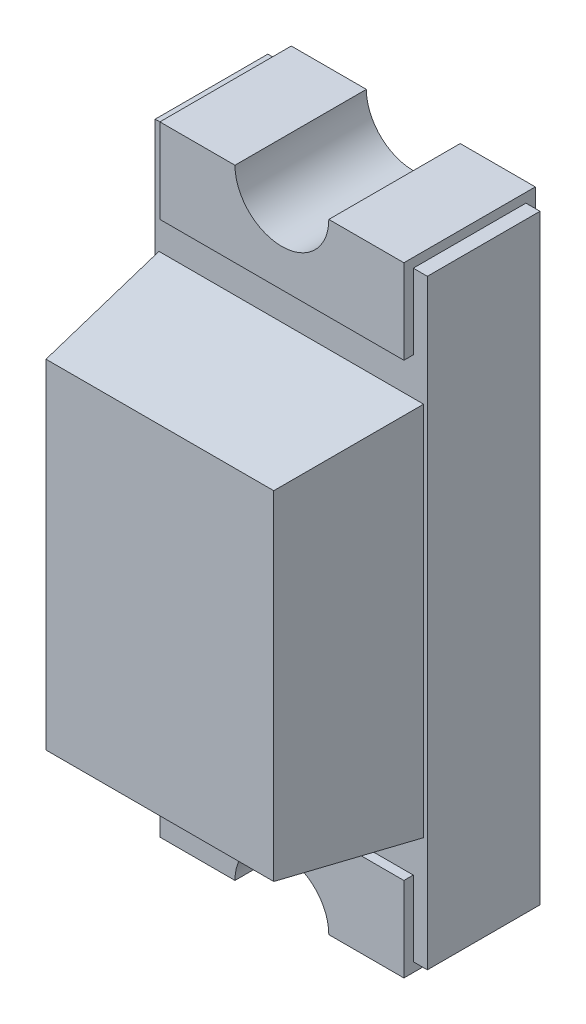
ISO-10303-21;
HEADER;
FILE_DESCRIPTION(('STEP AP214'),'2;1');
FILE_NAME('part.step','',(''),(''),'','','');
FILE_SCHEMA(('AUTOMOTIVE_DESIGN { 1 0 10303 214 1 1 1 1 }'));
ENDSEC;
DATA;
#1=APPLICATION_CONTEXT('core data for automotive mechanical design processes');
#2=APPLICATION_PROTOCOL_DEFINITION('international standard','automotive_design',2000,#1);
#3=PRODUCT_CONTEXT('',#1,'mechanical');
#4=PRODUCT('Part','Part','',(#3));
#5=PRODUCT_RELATED_PRODUCT_CATEGORY('part','',(#4));
#6=PRODUCT_DEFINITION_FORMATION('','',#4);
#7=PRODUCT_DEFINITION_CONTEXT('part definition',#1,'design');
#8=PRODUCT_DEFINITION('design','',#6,#7);
#9=PRODUCT_DEFINITION_SHAPE('','',#8);
#10=(LENGTH_UNIT() NAMED_UNIT(*) SI_UNIT(.MILLI.,.METRE.));
#11=(NAMED_UNIT(*) PLANE_ANGLE_UNIT() SI_UNIT($,.RADIAN.));
#12=(NAMED_UNIT(*) SI_UNIT($,.STERADIAN.) SOLID_ANGLE_UNIT());
#13=UNCERTAINTY_MEASURE_WITH_UNIT(LENGTH_MEASURE(1.E-05),#10,'distance_accuracy_value','');
#14=(GEOMETRIC_REPRESENTATION_CONTEXT(3) GLOBAL_UNCERTAINTY_ASSIGNED_CONTEXT((#13)) GLOBAL_UNIT_ASSIGNED_CONTEXT((#10,
#11,#12)) REPRESENTATION_CONTEXT('',''));
#15=CARTESIAN_POINT('',(0.,0.,0.));
#16=DIRECTION('',(0.,0.,1.));
#17=DIRECTION('',(1.,0.,0.));
#18=AXIS2_PLACEMENT_3D('',#15,#16,#17);
#19=CARTESIAN_POINT('',(0.,0.,0.675));
#20=DIRECTION('',(0.,0.,1.));
#21=DIRECTION('',(1.,0.,0.));
#22=AXIS2_PLACEMENT_3D('',#19,#20,#21);
#23=PLANE('',#22);
#24=DIRECTION('',(0.,1.,0.));
#25=VECTOR('',#24,1.);
#26=CARTESIAN_POINT('',(1.5019244506589,-0.117441590055801,0.675));
#27=LINE('',#26,#25);
#28=CARTESIAN_POINT('',(1.5019244506589,-0.166630882201638,0.675));
#29=VERTEX_POINT('',#28);
#30=CARTESIAN_POINT('',(1.5019244506589,-1.06825229790996,0.675));
#31=VERTEX_POINT('',#30);
#32=EDGE_CURVE('E315',#29,#31,#27,.F.);
#33=ORIENTED_EDGE('',*,*,#32,.F.);
#34=DIRECTION('',(1.,0.,0.));
#35=VECTOR('',#34,1.);
#36=CARTESIAN_POINT('',(0.846113742804735,-0.166630882201638,0.675));
#37=LINE('',#36,#35);
#38=CARTESIAN_POINT('',(0.895303034950573,-0.166630882201638,0.675));
#39=VERTEX_POINT('',#38);
#40=EDGE_CURVE('E320',#39,#29,#37,.T.);
#41=ORIENTED_EDGE('',*,*,#40,.F.);
#42=DIRECTION('',(0.,1.,0.));
#43=VECTOR('',#42,1.);
#44=CARTESIAN_POINT('',(0.895303034950572,-0.117441590055801,0.675));
#45=LINE('',#44,#43);
#46=CARTESIAN_POINT('',(0.895303034950573,-1.06825229790996,0.675));
#47=VERTEX_POINT('',#46);
#48=EDGE_CURVE('E325',#47,#39,#45,.T.);
#49=ORIENTED_EDGE('',*,*,#48,.F.);
#50=DIRECTION('',(1.,0.,0.));
#51=VECTOR('',#50,1.);
#52=CARTESIAN_POINT('',(0.846113742804736,-1.06825229790996,0.675));
#53=LINE('',#52,#51);
#54=EDGE_CURVE('E330',#31,#47,#53,.F.);
#55=ORIENTED_EDGE('',*,*,#54,.F.);
#56=EDGE_LOOP('',(#33,#41,#49,#55));
#57=FACE_BOUND('',#56,.T.);
#58=ADVANCED_FACE('F17',(#57),#23,.T.);
#59=CARTESIAN_POINT('',(1.19861374280474,0.207558409944199,0.35));
#60=DIRECTION('',(0.,0.,-1.));
#61=DIRECTION('',(-1.,0.,0.));
#62=AXIS2_PLACEMENT_3D('',#59,#60,#61);
#63=CYLINDRICAL_SURFACE('',#62,0.125);
#64=DIRECTION('',(0.,0.,-1.));
#65=VECTOR('',#64,1.);
#66=CARTESIAN_POINT('',(1.07361374280474,0.207558409944199,0.35));
#67=LINE('',#66,#65);
#68=CARTESIAN_POINT('',(1.07361374280474,0.207558409944199,0.));
#69=VERTEX_POINT('',#68);
#70=CARTESIAN_POINT('',(1.07361374280474,0.207558409944199,0.35));
#71=VERTEX_POINT('',#70);
#72=EDGE_CURVE('E205',#69,#71,#67,.F.);
#73=ORIENTED_EDGE('',*,*,#72,.T.);
#74=CARTESIAN_POINT('',(1.19861374280474,0.207558409944199,0.35));
#75=DIRECTION('',(0.,0.,-1.));
#76=DIRECTION('',(-1.,0.,0.));
#77=AXIS2_PLACEMENT_3D('',#74,#75,#76);
#78=CIRCLE('',#77,0.125);
#79=CARTESIAN_POINT('',(1.32361374280474,0.207558409944199,0.35));
#80=VERTEX_POINT('',#79);
#81=EDGE_CURVE('E224',#80,#71,#78,.T.);
#82=ORIENTED_EDGE('',*,*,#81,.F.);
#83=DIRECTION('',(0.,0.,-1.));
#84=VECTOR('',#83,1.);
#85=CARTESIAN_POINT('',(1.32361374280474,0.207558409944199,0.35));
#86=LINE('',#85,#84);
#87=CARTESIAN_POINT('',(1.32361374280474,0.207558409944199,0.));
#88=VERTEX_POINT('',#87);
#89=EDGE_CURVE('E199',#80,#88,#86,.T.);
#90=ORIENTED_EDGE('',*,*,#89,.T.);
#91=CARTESIAN_POINT('',(1.19861374280474,0.207558409944199,0.));
#92=DIRECTION('',(0.,0.,-1.));
#93=DIRECTION('',(-1.,0.,0.));
#94=AXIS2_PLACEMENT_3D('',#91,#92,#93);
#95=CIRCLE('',#94,0.125);
#96=EDGE_CURVE('E20',#88,#69,#95,.T.);
#97=ORIENTED_EDGE('',*,*,#96,.T.);
#98=EDGE_LOOP('',(#73,#82,#90,#97));
#99=FACE_BOUND('',#98,.T.);
#100=ADVANCED_FACE('F213',(#99),#63,.F.);
#101=CARTESIAN_POINT('',(0.846113742804736,-1.1174415900558,0.325));
#102=DIRECTION('',(0.,-0.99026806874157,0.139173100960065));
#103=DIRECTION('',(0.,-0.139173100960065,-0.99026806874157));
#104=AXIS2_PLACEMENT_3D('',#101,#102,#103);
#105=PLANE('',#104);
#106=ORIENTED_EDGE('',*,*,#54,.T.);
#107=DIRECTION('',(0.137844537491629,0.137844537491629,0.980814848463989));
#108=VECTOR('',#107,1.);
#109=CARTESIAN_POINT('',(0.846113742804736,-1.1174415900558,0.325));
#110=LINE('',#109,#108);
#111=CARTESIAN_POINT('',(0.846113742804736,-1.1174415900558,0.325));
#112=VERTEX_POINT('',#111);
#113=EDGE_CURVE('E327',#112,#47,#110,.T.);
#114=ORIENTED_EDGE('',*,*,#113,.F.);
#115=DIRECTION('',(1.,0.,0.));
#116=VECTOR('',#115,1.);
#117=CARTESIAN_POINT('',(1.19861374280474,-1.1174415900558,0.325));
#118=LINE('',#117,#116);
#119=CARTESIAN_POINT('',(1.55111374280474,-1.1174415900558,0.325));
#120=VERTEX_POINT('',#119);
#121=EDGE_CURVE('E396',#120,#112,#118,.F.);
#122=ORIENTED_EDGE('',*,*,#121,.F.);
#123=DIRECTION('',(0.137844537491629,-0.137844537491629,-0.980814848463989));
#124=VECTOR('',#123,1.);
#125=CARTESIAN_POINT('',(1.5019244506589,-1.06825229790996,0.675));
#126=LINE('',#125,#124);
#127=EDGE_CURVE('E271',#31,#120,#126,.T.);
#128=ORIENTED_EDGE('',*,*,#127,.F.);
#129=EDGE_LOOP('',(#106,#114,#122,#128));
#130=FACE_BOUND('',#129,.T.);
#131=ADVANCED_FACE('F786',(#130),#105,.T.);
#132=CARTESIAN_POINT('',(0.846113742804735,-0.117441590055801,0.325));
#133=DIRECTION('',(-0.99026806874157,0.,0.139173100960065));
#134=DIRECTION('',(0.139173100960065,0.,0.99026806874157));
#135=AXIS2_PLACEMENT_3D('',#132,#133,#134);
#136=PLANE('',#135);
#137=ORIENTED_EDGE('',*,*,#48,.T.);
#138=DIRECTION('',(0.137844537491629,-0.137844537491629,0.980814848463989));
#139=VECTOR('',#138,1.);
#140=CARTESIAN_POINT('',(0.846113742804735,-0.117441590055801,0.325));
#141=LINE('',#140,#139);
#142=CARTESIAN_POINT('',(0.846113742804735,-0.117441590055801,0.325));
#143=VERTEX_POINT('',#142);
#144=EDGE_CURVE('E322',#143,#39,#141,.T.);
#145=ORIENTED_EDGE('',*,*,#144,.F.);
#146=DIRECTION('',(0.,1.,0.));
#147=VECTOR('',#146,1.);
#148=CARTESIAN_POINT('',(0.846113742804736,-1.4174415900558,0.325));
#149=LINE('',#148,#147);
#150=EDGE_CURVE('E394',#112,#143,#149,.T.);
#151=ORIENTED_EDGE('',*,*,#150,.F.);
#152=ORIENTED_EDGE('',*,*,#113,.T.);
#153=EDGE_LOOP('',(#137,#145,#151,#152));
#154=FACE_BOUND('',#153,.T.);
#155=ADVANCED_FACE('F776',(#154),#136,.T.);
#156=CARTESIAN_POINT('',(0.846113742804735,-0.117441590055801,0.325));
#157=DIRECTION('',(0.,0.99026806874157,0.139173100960065));
#158=DIRECTION('',(0.,-0.139173100960065,0.99026806874157));
#159=AXIS2_PLACEMENT_3D('',#156,#157,#158);
#160=PLANE('',#159);
#161=ORIENTED_EDGE('',*,*,#40,.T.);
#162=DIRECTION('',(-0.137844537491629,-0.137844537491629,0.980814848463989));
#163=VECTOR('',#162,1.);
#164=CARTESIAN_POINT('',(1.55111374280474,-0.117441590055801,0.325));
#165=LINE('',#164,#163);
#166=CARTESIAN_POINT('',(1.55111374280474,-0.117441590055801,0.325));
#167=VERTEX_POINT('',#166);
#168=EDGE_CURVE('E317',#167,#29,#165,.T.);
#169=ORIENTED_EDGE('',*,*,#168,.F.);
#170=DIRECTION('',(1.,0.,0.));
#171=VECTOR('',#170,1.);
#172=CARTESIAN_POINT('',(1.19861374280474,-0.117441590055801,0.325));
#173=LINE('',#172,#171);
#174=EDGE_CURVE('E392',#143,#167,#173,.T.);
#175=ORIENTED_EDGE('',*,*,#174,.F.);
#176=ORIENTED_EDGE('',*,*,#144,.T.);
#177=EDGE_LOOP('',(#161,#169,#175,#176));
#178=FACE_BOUND('',#177,.T.);
#179=ADVANCED_FACE('F766',(#178),#160,.T.);
#180=CARTESIAN_POINT('',(1.55111374280474,-0.117441590055801,0.325));
#181=DIRECTION('',(0.99026806874157,0.,0.139173100960065));
#182=DIRECTION('',(0.139173100960065,0.,-0.99026806874157));
#183=AXIS2_PLACEMENT_3D('',#180,#181,#182);
#184=PLANE('',#183);
#185=ORIENTED_EDGE('',*,*,#32,.T.);
#186=ORIENTED_EDGE('',*,*,#127,.T.);
#187=DIRECTION('',(0.,1.,0.));
#188=VECTOR('',#187,1.);
#189=CARTESIAN_POINT('',(1.55111374280474,-1.4174415900558,0.325));
#190=LINE('',#189,#188);
#191=EDGE_CURVE('E389',#167,#120,#190,.F.);
#192=ORIENTED_EDGE('',*,*,#191,.F.);
#193=ORIENTED_EDGE('',*,*,#168,.T.);
#194=EDGE_LOOP('',(#185,#186,#192,#193));
#195=FACE_BOUND('',#194,.T.);
#196=ADVANCED_FACE('F756',(#195),#184,.T.);
#197=CARTESIAN_POINT('',(1.19861374280474,-1.4424415900558,0.35));
#198=DIRECTION('',(0.,0.,-1.));
#199=DIRECTION('',(-1.,0.,0.));
#200=AXIS2_PLACEMENT_3D('',#197,#198,#199);
#201=CYLINDRICAL_SURFACE('',#200,0.125);
#202=DIRECTION('',(0.,0.,1.));
#203=VECTOR('',#202,1.);
#204=CARTESIAN_POINT('',(1.32361374280474,-1.4424415900558,0.35));
#205=LINE('',#204,#203);
#206=CARTESIAN_POINT('',(1.32361374280474,-1.4424415900558,0.));
#207=VERTEX_POINT('',#206);
#208=CARTESIAN_POINT('',(1.32361374280474,-1.4424415900558,0.35));
#209=VERTEX_POINT('',#208);
#210=EDGE_CURVE('E268',#207,#209,#205,.T.);
#211=ORIENTED_EDGE('',*,*,#210,.T.);
#212=CARTESIAN_POINT('',(1.19861374280474,-1.4424415900558,0.35));
#213=DIRECTION('',(0.,0.,-1.));
#214=DIRECTION('',(-1.,0.,0.));
#215=AXIS2_PLACEMENT_3D('',#212,#213,#214);
#216=CIRCLE('',#215,0.125);
#217=CARTESIAN_POINT('',(1.07361374280474,-1.4424415900558,0.35));
#218=VERTEX_POINT('',#217);
#219=EDGE_CURVE('E248',#218,#209,#216,.T.);
#220=ORIENTED_EDGE('',*,*,#219,.F.);
#221=DIRECTION('',(0.,0.,1.));
#222=VECTOR('',#221,1.);
#223=CARTESIAN_POINT('',(1.07361374280474,-1.4424415900558,0.35));
#224=LINE('',#223,#222);
#225=CARTESIAN_POINT('',(1.07361374280474,-1.4424415900558,0.));
#226=VERTEX_POINT('',#225);
#227=EDGE_CURVE('E284',#218,#226,#224,.F.);
#228=ORIENTED_EDGE('',*,*,#227,.T.);
#229=CARTESIAN_POINT('',(1.19861374280474,-1.4424415900558,0.));
#230=DIRECTION('',(0.,0.,-1.));
#231=DIRECTION('',(-1.,0.,0.));
#232=AXIS2_PLACEMENT_3D('',#229,#230,#231);
#233=CIRCLE('',#232,0.125);
#234=EDGE_CURVE('E243',#226,#207,#233,.T.);
#235=ORIENTED_EDGE('',*,*,#234,.T.);
#236=EDGE_LOOP('',(#211,#220,#228,#235));
#237=FACE_BOUND('',#236,.T.);
#238=ADVANCED_FACE('F746',(#237),#201,.F.);
#239=CARTESIAN_POINT('',(1.32361374280474,-1.4424415900558,0.35));
#240=DIRECTION('',(0.,1.,0.));
#241=DIRECTION('',(0.,0.,1.));
#242=AXIS2_PLACEMENT_3D('',#239,#240,#241);
#243=PLANE('',#242);
#244=DIRECTION('',(0.,0.,1.));
#245=VECTOR('',#244,1.);
#246=CARTESIAN_POINT('',(1.52361374280474,-1.4424415900558,0.35));
#247=LINE('',#246,#245);
#248=CARTESIAN_POINT('',(1.52361374280474,-1.4424415900558,0.));
#249=VERTEX_POINT('',#248);
#250=CARTESIAN_POINT('',(1.52361374280474,-1.4424415900558,0.35));
#251=VERTEX_POINT('',#250);
#252=EDGE_CURVE('E272',#249,#251,#247,.T.);
#253=ORIENTED_EDGE('',*,*,#252,.T.);
#254=DIRECTION('',(1.,0.,0.));
#255=VECTOR('',#254,1.);
#256=CARTESIAN_POINT('',(1.19861374280474,-1.4424415900558,0.35));
#257=LINE('',#256,#255);
#258=EDGE_CURVE('E249',#209,#251,#257,.T.);
#259=ORIENTED_EDGE('',*,*,#258,.F.);
#260=ORIENTED_EDGE('',*,*,#210,.F.);
#261=DIRECTION('',(1.,0.,0.));
#262=VECTOR('',#261,1.);
#263=CARTESIAN_POINT('',(1.19861374280474,-1.4424415900558,0.));
#264=LINE('',#263,#262);
#265=EDGE_CURVE('E246',#207,#249,#264,.T.);
#266=ORIENTED_EDGE('',*,*,#265,.T.);
#267=EDGE_LOOP('',(#253,#259,#260,#266));
#268=FACE_BOUND('',#267,.T.);
#269=ADVANCED_FACE('F736',(#268),#243,.F.);
#270=CARTESIAN_POINT('',(1.32361374280474,0.207558409944199,0.35));
#271=DIRECTION('',(0.,-1.,0.));
#272=DIRECTION('',(0.,0.,-1.));
#273=AXIS2_PLACEMENT_3D('',#270,#271,#272);
#274=PLANE('',#273);
#275=ORIENTED_EDGE('',*,*,#89,.F.);
#276=DIRECTION('',(1.,0.,0.));
#277=VECTOR('',#276,1.);
#278=CARTESIAN_POINT('',(1.19861374280474,0.207558409944199,0.35));
#279=LINE('',#278,#277);
#280=CARTESIAN_POINT('',(1.52361374280474,0.207558409944199,0.35));
#281=VERTEX_POINT('',#280);
#282=EDGE_CURVE('E221',#281,#80,#279,.F.);
#283=ORIENTED_EDGE('',*,*,#282,.F.);
#284=DIRECTION('',(0.,0.,1.));
#285=VECTOR('',#284,1.);
#286=CARTESIAN_POINT('',(1.52361374280474,0.207558409944199,0.35));
#287=LINE('',#286,#285);
#288=CARTESIAN_POINT('',(1.52361374280474,0.207558409944199,0.));
#289=VERTEX_POINT('',#288);
#290=EDGE_CURVE('E240',#281,#289,#287,.F.);
#291=ORIENTED_EDGE('',*,*,#290,.T.);
#292=DIRECTION('',(1.,0.,0.));
#293=VECTOR('',#292,1.);
#294=CARTESIAN_POINT('',(1.19861374280474,0.207558409944199,0.));
#295=LINE('',#294,#293);
#296=EDGE_CURVE('E216',#289,#88,#295,.F.);
#297=ORIENTED_EDGE('',*,*,#296,.T.);
#298=EDGE_LOOP('',(#275,#283,#291,#297));
#299=FACE_BOUND('',#298,.T.);
#300=ADVANCED_FACE('F727',(#299),#274,.F.);
#301=CARTESIAN_POINT('',(1.19861374280474,0.207558409944199,0.));
#302=DIRECTION('',(0.,0.,1.));
#303=DIRECTION('',(1.,0.,0.));
#304=AXIS2_PLACEMENT_3D('',#301,#302,#303);
#305=PLANE('',#304);
#306=DIRECTION('',(1.,0.,0.));
#307=VECTOR('',#306,1.);
#308=CARTESIAN_POINT('',(0.873613742804736,0.207558409944199,0.));
#309=LINE('',#308,#307);
#310=CARTESIAN_POINT('',(0.873613742804736,0.207558409944199,0.));
#311=VERTEX_POINT('',#310);
#312=EDGE_CURVE('E209',#311,#69,#309,.T.);
#313=ORIENTED_EDGE('',*,*,#312,.T.);
#314=ORIENTED_EDGE('',*,*,#96,.F.);
#315=ORIENTED_EDGE('',*,*,#296,.F.);
#316=DIRECTION('',(0.,1.,0.));
#317=VECTOR('',#316,1.);
#318=CARTESIAN_POINT('',(1.52361374280474,0.207558409944199,0.));
#319=LINE('',#318,#317);
#320=CARTESIAN_POINT('',(1.52361374280474,-0.0174415900558012,0.));
#321=VERTEX_POINT('',#320);
#322=EDGE_CURVE('E237',#289,#321,#319,.F.);
#323=ORIENTED_EDGE('',*,*,#322,.T.);
#324=DIRECTION('',(1.,0.,0.));
#325=VECTOR('',#324,1.);
#326=CARTESIAN_POINT('',(0.873613742804736,-0.0174415900558012,0.));
#327=LINE('',#326,#325);
#328=CARTESIAN_POINT('',(0.873613742804736,-0.0174415900558012,0.));
#329=VERTEX_POINT('',#328);
#330=EDGE_CURVE('E439',#321,#329,#327,.F.);
#331=ORIENTED_EDGE('',*,*,#330,.T.);
#332=DIRECTION('',(0.,1.,0.));
#333=VECTOR('',#332,1.);
#334=CARTESIAN_POINT('',(0.873613742804736,0.207558409944199,0.));
#335=LINE('',#334,#333);
#336=EDGE_CURVE('E220',#329,#311,#335,.T.);
#337=ORIENTED_EDGE('',*,*,#336,.T.);
#338=EDGE_LOOP('',(#313,#314,#315,#323,#331,#337));
#339=FACE_BOUND('',#338,.T.);
#340=ADVANCED_FACE('F218',(#339),#305,.F.);
#341=CARTESIAN_POINT('',(0.873613742804736,0.207558409944199,0.35));
#342=DIRECTION('',(0.,-1.,0.));
#343=DIRECTION('',(0.,0.,-1.));
#344=AXIS2_PLACEMENT_3D('',#341,#342,#343);
#345=PLANE('',#344);
#346=DIRECTION('',(0.,0.,-1.));
#347=VECTOR('',#346,1.);
#348=CARTESIAN_POINT('',(0.873613742804736,0.207558409944199,0.35));
#349=LINE('',#348,#347);
#350=CARTESIAN_POINT('',(0.873613742804736,0.207558409944199,0.35));
#351=VERTEX_POINT('',#350);
#352=EDGE_CURVE('E233',#311,#351,#349,.F.);
#353=ORIENTED_EDGE('',*,*,#352,.T.);
#354=DIRECTION('',(1.,0.,0.));
#355=VECTOR('',#354,1.);
#356=CARTESIAN_POINT('',(1.19861374280474,0.207558409944199,0.35));
#357=LINE('',#356,#355);
#358=EDGE_CURVE('E211',#71,#351,#357,.F.);
#359=ORIENTED_EDGE('',*,*,#358,.F.);
#360=ORIENTED_EDGE('',*,*,#72,.F.);
#361=ORIENTED_EDGE('',*,*,#312,.F.);
#362=EDGE_LOOP('',(#353,#359,#360,#361));
#363=FACE_BOUND('',#362,.T.);
#364=ADVANCED_FACE('F207',(#363),#345,.F.);
#365=CARTESIAN_POINT('',(1.19861374280474,0.207558409944199,0.35));
#366=DIRECTION('',(0.,0.,1.));
#367=DIRECTION('',(1.,0.,0.));
#368=AXIS2_PLACEMENT_3D('',#365,#366,#367);
#369=PLANE('',#368);
#370=ORIENTED_EDGE('',*,*,#81,.T.);
#371=ORIENTED_EDGE('',*,*,#358,.T.);
#372=DIRECTION('',(0.,1.,0.));
#373=VECTOR('',#372,1.);
#374=CARTESIAN_POINT('',(0.873613742804736,0.207558409944199,0.35));
#375=LINE('',#374,#373);
#376=CARTESIAN_POINT('',(0.873613742804736,-0.0174415900558012,0.35));
#377=VERTEX_POINT('',#376);
#378=EDGE_CURVE('E332',#351,#377,#375,.F.);
#379=ORIENTED_EDGE('',*,*,#378,.T.);
#380=DIRECTION('',(1.,0.,0.));
#381=VECTOR('',#380,1.);
#382=CARTESIAN_POINT('',(0.873613742804736,-0.0174415900558012,0.35));
#383=LINE('',#382,#381);
#384=CARTESIAN_POINT('',(1.52361374280474,-0.0174415900558012,0.35));
#385=VERTEX_POINT('',#384);
#386=EDGE_CURVE('E252',#377,#385,#383,.T.);
#387=ORIENTED_EDGE('',*,*,#386,.T.);
#388=DIRECTION('',(0.,1.,0.));
#389=VECTOR('',#388,1.);
#390=CARTESIAN_POINT('',(1.52361374280474,0.207558409944199,0.35));
#391=LINE('',#390,#389);
#392=EDGE_CURVE('E343',#385,#281,#391,.T.);
#393=ORIENTED_EDGE('',*,*,#392,.T.);
#394=ORIENTED_EDGE('',*,*,#282,.T.);
#395=EDGE_LOOP('',(#370,#371,#379,#387,#393,#394));
#396=FACE_BOUND('',#395,.T.);
#397=ADVANCED_FACE('F701',(#396),#369,.T.);
#398=CARTESIAN_POINT('',(0.873613742804736,-0.0174415900558012,0.35));
#399=DIRECTION('',(0.,1.,0.));
#400=DIRECTION('',(0.,0.,1.));
#401=AXIS2_PLACEMENT_3D('',#398,#399,#400);
#402=PLANE('',#401);
#403=DIRECTION('',(1.,0.,0.));
#404=VECTOR('',#403,1.);
#405=CARTESIAN_POINT('',(1.19861374280474,-0.0174415900558013,0.325));
#406=LINE('',#405,#404);
#407=CARTESIAN_POINT('',(1.52361374280474,-0.0174415900558013,0.325));
#408=VERTEX_POINT('',#407);
#409=CARTESIAN_POINT('',(0.873613742804736,-0.0174415900558013,0.325));
#410=VERTEX_POINT('',#409);
#411=EDGE_CURVE('E398',#408,#410,#406,.F.);
#412=ORIENTED_EDGE('',*,*,#411,.F.);
#413=DIRECTION('',(0.,0.,1.));
#414=VECTOR('',#413,1.);
#415=CARTESIAN_POINT('',(1.52361374280474,-0.0174415900558012,0.35));
#416=LINE('',#415,#414);
#417=EDGE_CURVE('E444',#408,#385,#416,.T.);
#418=ORIENTED_EDGE('',*,*,#417,.T.);
#419=ORIENTED_EDGE('',*,*,#386,.F.);
#420=DIRECTION('',(0.,0.,-1.));
#421=VECTOR('',#420,1.);
#422=CARTESIAN_POINT('',(0.873613742804736,-0.0174415900558012,0.35));
#423=LINE('',#422,#421);
#424=EDGE_CURVE('E334',#377,#410,#423,.T.);
#425=ORIENTED_EDGE('',*,*,#424,.T.);
#426=EDGE_LOOP('',(#412,#418,#419,#425));
#427=FACE_BOUND('',#426,.T.);
#428=ADVANCED_FACE('F691',(#427),#402,.F.);
#429=CARTESIAN_POINT('',(1.19861374280474,-1.4174415900558,0.325));
#430=DIRECTION('',(0.,0.,1.));
#431=DIRECTION('',(1.,0.,0.));
#432=AXIS2_PLACEMENT_3D('',#429,#430,#431);
#433=PLANE('',#432);
#434=ORIENTED_EDGE('',*,*,#174,.T.);
#435=ORIENTED_EDGE('',*,*,#191,.T.);
#436=ORIENTED_EDGE('',*,*,#121,.T.);
#437=ORIENTED_EDGE('',*,*,#150,.T.);
#438=EDGE_LOOP('',(#434,#435,#436,#437));
#439=FACE_BOUND('',#438,.T.);
#440=DIRECTION('',(1.,0.,0.));
#441=VECTOR('',#440,1.);
#442=CARTESIAN_POINT('',(0.836113742804736,0.182558409944199,0.325));
#443=LINE('',#442,#441);
#444=CARTESIAN_POINT('',(0.873613742804736,0.182558409944199,0.325));
#445=VERTEX_POINT('',#444);
#446=CARTESIAN_POINT('',(0.836113742804736,0.182558409944199,0.325));
#447=VERTEX_POINT('',#446);
#448=EDGE_CURVE('E428',#445,#447,#443,.F.);
#449=ORIENTED_EDGE('',*,*,#448,.T.);
#450=DIRECTION('',(0.,1.,0.));
#451=VECTOR('',#450,1.);
#452=CARTESIAN_POINT('',(0.836113742804736,0.182558409944199,0.325));
#453=LINE('',#452,#451);
#454=CARTESIAN_POINT('',(0.836113742804736,-1.4174415900558,0.325));
#455=VERTEX_POINT('',#454);
#456=EDGE_CURVE('E405',#447,#455,#453,.F.);
#457=ORIENTED_EDGE('',*,*,#456,.T.);
#458=DIRECTION('',(1.,0.,0.));
#459=VECTOR('',#458,1.);
#460=CARTESIAN_POINT('',(1.19861374280474,-1.4174415900558,0.325));
#461=LINE('',#460,#459);
#462=CARTESIAN_POINT('',(0.873613742804736,-1.4174415900558,0.325));
#463=VERTEX_POINT('',#462);
#464=EDGE_CURVE('E257',#455,#463,#461,.T.);
#465=ORIENTED_EDGE('',*,*,#464,.T.);
#466=DIRECTION('',(0.,1.,0.));
#467=VECTOR('',#466,1.);
#468=CARTESIAN_POINT('',(0.873613742804736,-1.4174415900558,0.325));
#469=LINE('',#468,#467);
#470=CARTESIAN_POINT('',(0.873613742804736,-1.2174415900558,0.325));
#471=VERTEX_POINT('',#470);
#472=EDGE_CURVE('E400',#463,#471,#469,.T.);
#473=ORIENTED_EDGE('',*,*,#472,.T.);
#474=DIRECTION('',(1.,0.,0.));
#475=VECTOR('',#474,1.);
#476=CARTESIAN_POINT('',(0.873613742804736,-1.2174415900558,0.325));
#477=LINE('',#476,#475);
#478=CARTESIAN_POINT('',(1.52361374280474,-1.2174415900558,0.325));
#479=VERTEX_POINT('',#478);
#480=EDGE_CURVE('E250',#471,#479,#477,.T.);
#481=ORIENTED_EDGE('',*,*,#480,.T.);
#482=DIRECTION('',(0.,1.,0.));
#483=VECTOR('',#482,1.);
#484=CARTESIAN_POINT('',(1.52361374280474,-1.2174415900558,0.325));
#485=LINE('',#484,#483);
#486=CARTESIAN_POINT('',(1.52361374280474,-1.4174415900558,0.325));
#487=VERTEX_POINT('',#486);
#488=EDGE_CURVE('E368',#479,#487,#485,.F.);
#489=ORIENTED_EDGE('',*,*,#488,.T.);
#490=DIRECTION('',(1.,0.,0.));
#491=VECTOR('',#490,1.);
#492=CARTESIAN_POINT('',(1.37361374280474,-1.4174415900558,0.325));
#493=LINE('',#492,#491);
#494=CARTESIAN_POINT('',(1.56111374280474,-1.4174415900558,0.325));
#495=VERTEX_POINT('',#494);
#496=EDGE_CURVE('E366',#487,#495,#493,.T.);
#497=ORIENTED_EDGE('',*,*,#496,.T.);
#498=DIRECTION('',(0.,1.,0.));
#499=VECTOR('',#498,1.);
#500=CARTESIAN_POINT('',(1.56111374280474,0.182558409944199,0.325));
#501=LINE('',#500,#499);
#502=CARTESIAN_POINT('',(1.56111374280474,0.182558409944199,0.325));
#503=VERTEX_POINT('',#502);
#504=EDGE_CURVE('E354',#495,#503,#501,.T.);
#505=ORIENTED_EDGE('',*,*,#504,.T.);
#506=DIRECTION('',(1.,0.,0.));
#507=VECTOR('',#506,1.);
#508=CARTESIAN_POINT('',(1.37361374280474,0.182558409944199,0.325));
#509=LINE('',#508,#507);
#510=CARTESIAN_POINT('',(1.52361374280474,0.182558409944199,0.325));
#511=VERTEX_POINT('',#510);
#512=EDGE_CURVE('E346',#503,#511,#509,.F.);
#513=ORIENTED_EDGE('',*,*,#512,.T.);
#514=DIRECTION('',(0.,1.,0.));
#515=VECTOR('',#514,1.);
#516=CARTESIAN_POINT('',(1.52361374280474,0.207558409944199,0.325));
#517=LINE('',#516,#515);
#518=EDGE_CURVE('E446',#511,#408,#517,.F.);
#519=ORIENTED_EDGE('',*,*,#518,.T.);
#520=ORIENTED_EDGE('',*,*,#411,.T.);
#521=DIRECTION('',(0.,1.,0.));
#522=VECTOR('',#521,1.);
#523=CARTESIAN_POINT('',(0.873613742804736,0.207558409944199,0.325));
#524=LINE('',#523,#522);
#525=EDGE_CURVE('E433',#410,#445,#524,.T.);
#526=ORIENTED_EDGE('',*,*,#525,.T.);
#527=EDGE_LOOP('',(#449,#457,#465,#473,#481,#489,#497,#505,#513,#519,#520,#526));
#528=FACE_BOUND('',#527,.T.);
#529=ADVANCED_FACE('F402',(#439,#528),#433,.T.);
#530=CARTESIAN_POINT('',(0.873613742804736,-1.2174415900558,0.35));
#531=DIRECTION('',(0.,-1.,0.));
#532=DIRECTION('',(0.,0.,-1.));
#533=AXIS2_PLACEMENT_3D('',#530,#531,#532);
#534=PLANE('',#533);
#535=DIRECTION('',(0.,0.,-1.));
#536=VECTOR('',#535,1.);
#537=CARTESIAN_POINT('',(0.873613742804736,-1.2174415900558,0.35));
#538=LINE('',#537,#536);
#539=CARTESIAN_POINT('',(0.873613742804736,-1.2174415900558,0.35));
#540=VERTEX_POINT('',#539);
#541=EDGE_CURVE('E306',#471,#540,#538,.F.);
#542=ORIENTED_EDGE('',*,*,#541,.T.);
#543=DIRECTION('',(1.,0.,0.));
#544=VECTOR('',#543,1.);
#545=CARTESIAN_POINT('',(1.19861374280474,-1.2174415900558,0.35));
#546=LINE('',#545,#544);
#547=CARTESIAN_POINT('',(1.52361374280474,-1.2174415900558,0.35));
#548=VERTEX_POINT('',#547);
#549=EDGE_CURVE('E301',#548,#540,#546,.F.);
#550=ORIENTED_EDGE('',*,*,#549,.F.);
#551=DIRECTION('',(0.,0.,1.));
#552=VECTOR('',#551,1.);
#553=CARTESIAN_POINT('',(1.52361374280474,-1.2174415900558,0.35));
#554=LINE('',#553,#552);
#555=EDGE_CURVE('E311',#548,#479,#554,.F.);
#556=ORIENTED_EDGE('',*,*,#555,.T.);
#557=ORIENTED_EDGE('',*,*,#480,.F.);
#558=EDGE_LOOP('',(#542,#550,#556,#557));
#559=FACE_BOUND('',#558,.T.);
#560=ADVANCED_FACE('F505',(#559),#534,.F.);
#561=CARTESIAN_POINT('',(1.19861374280474,-1.4424415900558,0.35));
#562=DIRECTION('',(0.,0.,1.));
#563=DIRECTION('',(1.,0.,0.));
#564=AXIS2_PLACEMENT_3D('',#561,#562,#563);
#565=PLANE('',#564);
#566=DIRECTION('',(0.,1.,0.));
#567=VECTOR('',#566,1.);
#568=CARTESIAN_POINT('',(1.52361374280474,-1.2174415900558,0.35));
#569=LINE('',#568,#567);
#570=EDGE_CURVE('E275',#251,#548,#569,.T.);
#571=ORIENTED_EDGE('',*,*,#570,.T.);
#572=ORIENTED_EDGE('',*,*,#549,.T.);
#573=DIRECTION('',(0.,1.,0.));
#574=VECTOR('',#573,1.);
#575=CARTESIAN_POINT('',(0.873613742804736,-1.2174415900558,0.35));
#576=LINE('',#575,#574);
#577=CARTESIAN_POINT('',(0.873613742804736,-1.4424415900558,0.35));
#578=VERTEX_POINT('',#577);
#579=EDGE_CURVE('E296',#540,#578,#576,.F.);
#580=ORIENTED_EDGE('',*,*,#579,.T.);
#581=DIRECTION('',(1.,0.,0.));
#582=VECTOR('',#581,1.);
#583=CARTESIAN_POINT('',(0.873613742804736,-1.4424415900558,0.35));
#584=LINE('',#583,#582);
#585=EDGE_CURVE('E286',#578,#218,#584,.T.);
#586=ORIENTED_EDGE('',*,*,#585,.T.);
#587=ORIENTED_EDGE('',*,*,#219,.T.);
#588=ORIENTED_EDGE('',*,*,#258,.T.);
#589=EDGE_LOOP('',(#571,#572,#580,#586,#587,#588));
#590=FACE_BOUND('',#589,.T.);
#591=ADVANCED_FACE('F504',(#590),#565,.T.);
#592=CARTESIAN_POINT('',(0.873613742804736,-1.4424415900558,0.35));
#593=DIRECTION('',(0.,1.,0.));
#594=DIRECTION('',(0.,0.,1.));
#595=AXIS2_PLACEMENT_3D('',#592,#593,#594);
#596=PLANE('',#595);
#597=ORIENTED_EDGE('',*,*,#227,.F.);
#598=ORIENTED_EDGE('',*,*,#585,.F.);
#599=DIRECTION('',(0.,0.,-1.));
#600=VECTOR('',#599,1.);
#601=CARTESIAN_POINT('',(0.873613742804736,-1.4424415900558,0.35));
#602=LINE('',#601,#600);
#603=CARTESIAN_POINT('',(0.873613742804736,-1.4424415900558,0.));
#604=VERTEX_POINT('',#603);
#605=EDGE_CURVE('E291',#578,#604,#602,.T.);
#606=ORIENTED_EDGE('',*,*,#605,.T.);
#607=DIRECTION('',(1.,0.,0.));
#608=VECTOR('',#607,1.);
#609=CARTESIAN_POINT('',(1.19861374280474,-1.4424415900558,0.));
#610=LINE('',#609,#608);
#611=EDGE_CURVE('E247',#604,#226,#610,.T.);
#612=ORIENTED_EDGE('',*,*,#611,.T.);
#613=EDGE_LOOP('',(#597,#598,#606,#612));
#614=FACE_BOUND('',#613,.T.);
#615=ADVANCED_FACE('F502',(#614),#596,.F.);
#616=CARTESIAN_POINT('',(1.19861374280474,-1.4424415900558,0.));
#617=DIRECTION('',(0.,0.,1.));
#618=DIRECTION('',(1.,0.,0.));
#619=AXIS2_PLACEMENT_3D('',#616,#617,#618);
#620=PLANE('',#619);
#621=DIRECTION('',(1.,0.,0.));
#622=VECTOR('',#621,1.);
#623=CARTESIAN_POINT('',(0.873613742804736,-1.2174415900558,0.));
#624=LINE('',#623,#622);
#625=CARTESIAN_POINT('',(0.873613742804736,-1.2174415900558,0.));
#626=VERTEX_POINT('',#625);
#627=CARTESIAN_POINT('',(1.52361374280474,-1.2174415900558,0.));
#628=VERTEX_POINT('',#627);
#629=EDGE_CURVE('E375',#626,#628,#624,.T.);
#630=ORIENTED_EDGE('',*,*,#629,.T.);
#631=DIRECTION('',(0.,1.,0.));
#632=VECTOR('',#631,1.);
#633=CARTESIAN_POINT('',(1.52361374280474,-1.2174415900558,0.));
#634=LINE('',#633,#632);
#635=EDGE_CURVE('E276',#628,#249,#634,.F.);
#636=ORIENTED_EDGE('',*,*,#635,.T.);
#637=ORIENTED_EDGE('',*,*,#265,.F.);
#638=ORIENTED_EDGE('',*,*,#234,.F.);
#639=ORIENTED_EDGE('',*,*,#611,.F.);
#640=DIRECTION('',(0.,1.,0.));
#641=VECTOR('',#640,1.);
#642=CARTESIAN_POINT('',(0.873613742804736,-1.2174415900558,0.));
#643=LINE('',#642,#641);
#644=EDGE_CURVE('E287',#604,#626,#643,.T.);
#645=ORIENTED_EDGE('',*,*,#644,.T.);
#646=EDGE_LOOP('',(#630,#636,#637,#638,#639,#645));
#647=FACE_BOUND('',#646,.T.);
#648=ADVANCED_FACE('F497',(#647),#620,.F.);
#649=CARTESIAN_POINT('',(0.873613742804736,-1.2174415900558,0.35));
#650=DIRECTION('',(0.,-1.,0.));
#651=DIRECTION('',(0.,0.,-1.));
#652=AXIS2_PLACEMENT_3D('',#649,#650,#651);
#653=PLANE('',#652);
#654=DIRECTION('',(1.,0.,0.));
#655=VECTOR('',#654,1.);
#656=CARTESIAN_POINT('',(1.19861374280474,-1.2174415900558,0.025));
#657=LINE('',#656,#655);
#658=CARTESIAN_POINT('',(0.873613742804736,-1.2174415900558,0.025));
#659=VERTEX_POINT('',#658);
#660=CARTESIAN_POINT('',(1.52361374280474,-1.2174415900558,0.025));
#661=VERTEX_POINT('',#660);
#662=EDGE_CURVE('E411',#659,#661,#657,.T.);
#663=ORIENTED_EDGE('',*,*,#662,.T.);
#664=DIRECTION('',(0.,0.,1.));
#665=VECTOR('',#664,1.);
#666=CARTESIAN_POINT('',(1.52361374280474,-1.2174415900558,0.35));
#667=LINE('',#666,#665);
#668=EDGE_CURVE('E281',#661,#628,#667,.F.);
#669=ORIENTED_EDGE('',*,*,#668,.T.);
#670=ORIENTED_EDGE('',*,*,#629,.F.);
#671=DIRECTION('',(0.,0.,-1.));
#672=VECTOR('',#671,1.);
#673=CARTESIAN_POINT('',(0.873613742804736,-1.2174415900558,0.35));
#674=LINE('',#673,#672);
#675=EDGE_CURVE('E290',#626,#659,#674,.F.);
#676=ORIENTED_EDGE('',*,*,#675,.T.);
#677=EDGE_LOOP('',(#663,#669,#670,#676));
#678=FACE_BOUND('',#677,.T.);
#679=ADVANCED_FACE('F484',(#678),#653,.F.);
#680=CARTESIAN_POINT('',(1.52361374280474,-1.2174415900558,0.35));
#681=DIRECTION('',(-1.,0.,0.));
#682=DIRECTION('',(0.,0.,1.));
#683=AXIS2_PLACEMENT_3D('',#680,#681,#682);
#684=PLANE('',#683);
#685=ORIENTED_EDGE('',*,*,#555,.F.);
#686=ORIENTED_EDGE('',*,*,#570,.F.);
#687=ORIENTED_EDGE('',*,*,#252,.F.);
#688=ORIENTED_EDGE('',*,*,#635,.F.);
#689=ORIENTED_EDGE('',*,*,#668,.F.);
#690=DIRECTION('',(0.,1.,0.));
#691=VECTOR('',#690,1.);
#692=CARTESIAN_POINT('',(1.52361374280474,-1.4174415900558,0.025));
#693=LINE('',#692,#691);
#694=CARTESIAN_POINT('',(1.52361374280474,-1.4174415900558,0.025));
#695=VERTEX_POINT('',#694);
#696=EDGE_CURVE('E478',#661,#695,#693,.F.);
#697=ORIENTED_EDGE('',*,*,#696,.T.);
#698=DIRECTION('',(0.,0.,1.));
#699=VECTOR('',#698,1.);
#700=CARTESIAN_POINT('',(1.52361374280474,-1.4174415900558,0.325));
#701=LINE('',#700,#699);
#702=EDGE_CURVE('E363',#695,#487,#701,.T.);
#703=ORIENTED_EDGE('',*,*,#702,.T.);
#704=ORIENTED_EDGE('',*,*,#488,.F.);
#705=EDGE_LOOP('',(#685,#686,#687,#688,#689,#697,#703,#704));
#706=FACE_BOUND('',#705,.T.);
#707=ADVANCED_FACE('F490',(#706),#684,.F.);
#708=CARTESIAN_POINT('',(1.37361374280474,-1.4174415900558,0.325));
#709=DIRECTION('',(0.,1.,0.));
#710=DIRECTION('',(0.,0.,1.));
#711=AXIS2_PLACEMENT_3D('',#708,#709,#710);
#712=PLANE('',#711);
#713=DIRECTION('',(1.,0.,0.));
#714=VECTOR('',#713,1.);
#715=CARTESIAN_POINT('',(1.19861374280474,-1.4174415900558,0.025));
#716=LINE('',#715,#714);
#717=CARTESIAN_POINT('',(1.56111374280474,-1.4174415900558,0.025));
#718=VERTEX_POINT('',#717);
#719=EDGE_CURVE('E475',#695,#718,#716,.T.);
#720=ORIENTED_EDGE('',*,*,#719,.T.);
#721=DIRECTION('',(0.,0.,1.));
#722=VECTOR('',#721,1.);
#723=CARTESIAN_POINT('',(1.56111374280474,-1.4174415900558,0.325));
#724=LINE('',#723,#722);
#725=EDGE_CURVE('E360',#718,#495,#724,.T.);
#726=ORIENTED_EDGE('',*,*,#725,.T.);
#727=ORIENTED_EDGE('',*,*,#496,.F.);
#728=ORIENTED_EDGE('',*,*,#702,.F.);
#729=EDGE_LOOP('',(#720,#726,#727,#728));
#730=FACE_BOUND('',#729,.T.);
#731=ADVANCED_FACE('F510',(#730),#712,.F.);
#732=CARTESIAN_POINT('',(1.56111374280474,0.182558409944199,0.325));
#733=DIRECTION('',(-1.,0.,0.));
#734=DIRECTION('',(0.,0.,1.));
#735=AXIS2_PLACEMENT_3D('',#732,#733,#734);
#736=PLANE('',#735);
#737=DIRECTION('',(0.,0.,1.));
#738=VECTOR('',#737,1.);
#739=CARTESIAN_POINT('',(1.56111374280474,0.182558409944199,0.325));
#740=LINE('',#739,#738);
#741=CARTESIAN_POINT('',(1.56111374280474,0.182558409944199,0.025));
#742=VERTEX_POINT('',#741);
#743=EDGE_CURVE('E347',#742,#503,#740,.T.);
#744=ORIENTED_EDGE('',*,*,#743,.T.);
#745=ORIENTED_EDGE('',*,*,#504,.F.);
#746=ORIENTED_EDGE('',*,*,#725,.F.);
#747=DIRECTION('',(0.,1.,0.));
#748=VECTOR('',#747,1.);
#749=CARTESIAN_POINT('',(1.56111374280474,-1.4174415900558,0.025));
#750=LINE('',#749,#748);
#751=EDGE_CURVE('E470',#718,#742,#750,.T.);
#752=ORIENTED_EDGE('',*,*,#751,.T.);
#753=EDGE_LOOP('',(#744,#745,#746,#752));
#754=FACE_BOUND('',#753,.T.);
#755=ADVANCED_FACE('F509',(#754),#736,.F.);
#756=CARTESIAN_POINT('',(1.37361374280474,0.182558409944199,0.325));
#757=DIRECTION('',(0.,-1.,0.));
#758=DIRECTION('',(1.,0.,0.));
#759=AXIS2_PLACEMENT_3D('',#756,#757,#758);
#760=PLANE('',#759);
#761=DIRECTION('',(0.,0.,1.));
#762=VECTOR('',#761,1.);
#763=CARTESIAN_POINT('',(1.52361374280474,0.182558409944199,0.35));
#764=LINE('',#763,#762);
#765=CARTESIAN_POINT('',(1.52361374280474,0.182558409944199,0.025));
#766=VERTEX_POINT('',#765);
#767=EDGE_CURVE('E239',#766,#511,#764,.T.);
#768=ORIENTED_EDGE('',*,*,#767,.T.);
#769=ORIENTED_EDGE('',*,*,#512,.F.);
#770=ORIENTED_EDGE('',*,*,#743,.F.);
#771=DIRECTION('',(1.,0.,0.));
#772=VECTOR('',#771,1.);
#773=CARTESIAN_POINT('',(1.19861374280474,0.182558409944199,0.025));
#774=LINE('',#773,#772);
#775=EDGE_CURVE('E452',#742,#766,#774,.F.);
#776=ORIENTED_EDGE('',*,*,#775,.T.);
#777=EDGE_LOOP('',(#768,#769,#770,#776));
#778=FACE_BOUND('',#777,.T.);
#779=ADVANCED_FACE('F450',(#778),#760,.F.);
#780=CARTESIAN_POINT('',(1.52361374280474,0.207558409944199,0.35));
#781=DIRECTION('',(-1.,0.,0.));
#782=DIRECTION('',(0.,0.,1.));
#783=AXIS2_PLACEMENT_3D('',#780,#781,#782);
#784=PLANE('',#783);
#785=ORIENTED_EDGE('',*,*,#518,.F.);
#786=ORIENTED_EDGE('',*,*,#767,.F.);
#787=DIRECTION('',(0.,1.,0.));
#788=VECTOR('',#787,1.);
#789=CARTESIAN_POINT('',(1.52361374280474,-1.4174415900558,0.025));
#790=LINE('',#789,#788);
#791=CARTESIAN_POINT('',(1.52361374280474,-0.0174415900558013,0.025));
#792=VERTEX_POINT('',#791);
#793=EDGE_CURVE('E457',#766,#792,#790,.F.);
#794=ORIENTED_EDGE('',*,*,#793,.T.);
#795=DIRECTION('',(0.,0.,1.));
#796=VECTOR('',#795,1.);
#797=CARTESIAN_POINT('',(1.52361374280474,-0.0174415900558012,0.35));
#798=LINE('',#797,#796);
#799=EDGE_CURVE('E441',#792,#321,#798,.F.);
#800=ORIENTED_EDGE('',*,*,#799,.T.);
#801=ORIENTED_EDGE('',*,*,#322,.F.);
#802=ORIENTED_EDGE('',*,*,#290,.F.);
#803=ORIENTED_EDGE('',*,*,#392,.F.);
#804=ORIENTED_EDGE('',*,*,#417,.F.);
#805=EDGE_LOOP('',(#785,#786,#794,#800,#801,#802,#803,#804));
#806=FACE_BOUND('',#805,.T.);
#807=ADVANCED_FACE('F456',(#806),#784,.F.);
#808=CARTESIAN_POINT('',(0.873613742804736,-0.0174415900558012,0.35));
#809=DIRECTION('',(0.,1.,0.));
#810=DIRECTION('',(0.,0.,1.));
#811=AXIS2_PLACEMENT_3D('',#808,#809,#810);
#812=PLANE('',#811);
#813=DIRECTION('',(0.,0.,-1.));
#814=VECTOR('',#813,1.);
#815=CARTESIAN_POINT('',(0.873613742804736,-0.0174415900558012,0.35));
#816=LINE('',#815,#814);
#817=CARTESIAN_POINT('',(0.873613742804736,-0.0174415900558013,0.025));
#818=VERTEX_POINT('',#817);
#819=EDGE_CURVE('E234',#818,#329,#816,.T.);
#820=ORIENTED_EDGE('',*,*,#819,.T.);
#821=ORIENTED_EDGE('',*,*,#330,.F.);
#822=ORIENTED_EDGE('',*,*,#799,.F.);
#823=DIRECTION('',(1.,0.,0.));
#824=VECTOR('',#823,1.);
#825=CARTESIAN_POINT('',(1.19861374280474,-0.0174415900558013,0.025));
#826=LINE('',#825,#824);
#827=EDGE_CURVE('E466',#792,#818,#826,.F.);
#828=ORIENTED_EDGE('',*,*,#827,.T.);
#829=EDGE_LOOP('',(#820,#821,#822,#828));
#830=FACE_BOUND('',#829,.T.);
#831=ADVANCED_FACE('F540',(#830),#812,.F.);
#832=CARTESIAN_POINT('',(0.873613742804736,0.207558409944199,0.35));
#833=DIRECTION('',(1.,0.,0.));
#834=DIRECTION('',(0.,0.,-1.));
#835=AXIS2_PLACEMENT_3D('',#832,#833,#834);
#836=PLANE('',#835);
#837=ORIENTED_EDGE('',*,*,#525,.F.);
#838=ORIENTED_EDGE('',*,*,#424,.F.);
#839=ORIENTED_EDGE('',*,*,#378,.F.);
#840=ORIENTED_EDGE('',*,*,#352,.F.);
#841=ORIENTED_EDGE('',*,*,#336,.F.);
#842=ORIENTED_EDGE('',*,*,#819,.F.);
#843=DIRECTION('',(0.,1.,0.));
#844=VECTOR('',#843,1.);
#845=CARTESIAN_POINT('',(0.873613742804736,-1.4174415900558,0.025));
#846=LINE('',#845,#844);
#847=CARTESIAN_POINT('',(0.873613742804736,0.182558409944199,0.025));
#848=VERTEX_POINT('',#847);
#849=EDGE_CURVE('E468',#818,#848,#846,.T.);
#850=ORIENTED_EDGE('',*,*,#849,.T.);
#851=DIRECTION('',(0.,0.,-1.));
#852=VECTOR('',#851,1.);
#853=CARTESIAN_POINT('',(0.873613742804736,0.182558409944199,0.325));
#854=LINE('',#853,#852);
#855=EDGE_CURVE('E430',#848,#445,#854,.F.);
#856=ORIENTED_EDGE('',*,*,#855,.T.);
#857=EDGE_LOOP('',(#837,#838,#839,#840,#841,#842,#850,#856));
#858=FACE_BOUND('',#857,.T.);
#859=ADVANCED_FACE('F536',(#858),#836,.F.);
#860=CARTESIAN_POINT('',(0.836113742804736,0.182558409944199,0.325));
#861=DIRECTION('',(0.,-1.,0.));
#862=DIRECTION('',(0.,0.,-1.));
#863=AXIS2_PLACEMENT_3D('',#860,#861,#862);
#864=PLANE('',#863);
#865=ORIENTED_EDGE('',*,*,#855,.F.);
#866=DIRECTION('',(1.,0.,0.));
#867=VECTOR('',#866,1.);
#868=CARTESIAN_POINT('',(1.19861374280474,0.182558409944199,0.025));
#869=LINE('',#868,#867);
#870=CARTESIAN_POINT('',(0.836113742804736,0.182558409944199,0.025));
#871=VERTEX_POINT('',#870);
#872=EDGE_CURVE('E903',#848,#871,#869,.F.);
#873=ORIENTED_EDGE('',*,*,#872,.T.);
#874=DIRECTION('',(0.,0.,1.));
#875=VECTOR('',#874,1.);
#876=CARTESIAN_POINT('',(0.836113742804736,0.182558409944199,0.325));
#877=LINE('',#876,#875);
#878=EDGE_CURVE('E425',#871,#447,#877,.T.);
#879=ORIENTED_EDGE('',*,*,#878,.T.);
#880=ORIENTED_EDGE('',*,*,#448,.F.);
#881=EDGE_LOOP('',(#865,#873,#879,#880));
#882=FACE_BOUND('',#881,.T.);
#883=ADVANCED_FACE('F532',(#882),#864,.F.);
#884=CARTESIAN_POINT('',(0.836113742804736,0.182558409944199,0.325));
#885=DIRECTION('',(1.,0.,0.));
#886=DIRECTION('',(0.,1.,0.));
#887=AXIS2_PLACEMENT_3D('',#884,#885,#886);
#888=PLANE('',#887);
#889=DIRECTION('',(0.,0.,1.));
#890=VECTOR('',#889,1.);
#891=CARTESIAN_POINT('',(0.836113742804736,-1.4174415900558,0.325));
#892=LINE('',#891,#890);
#893=CARTESIAN_POINT('',(0.836113742804736,-1.4174415900558,0.025));
#894=VERTEX_POINT('',#893);
#895=EDGE_CURVE('E419',#894,#455,#892,.T.);
#896=ORIENTED_EDGE('',*,*,#895,.T.);
#897=ORIENTED_EDGE('',*,*,#456,.F.);
#898=ORIENTED_EDGE('',*,*,#878,.F.);
#899=DIRECTION('',(0.,1.,0.));
#900=VECTOR('',#899,1.);
#901=CARTESIAN_POINT('',(0.836113742804736,-1.4174415900558,0.025));
#902=LINE('',#901,#900);
#903=EDGE_CURVE('E906',#871,#894,#902,.F.);
#904=ORIENTED_EDGE('',*,*,#903,.T.);
#905=EDGE_LOOP('',(#896,#897,#898,#904));
#906=FACE_BOUND('',#905,.T.);
#907=ADVANCED_FACE('F529',(#906),#888,.F.);
#908=CARTESIAN_POINT('',(0.836113742804736,-1.4174415900558,0.325));
#909=DIRECTION('',(0.,1.,0.));
#910=DIRECTION('',(0.,0.,1.));
#911=AXIS2_PLACEMENT_3D('',#908,#909,#910);
#912=PLANE('',#911);
#913=ORIENTED_EDGE('',*,*,#464,.F.);
#914=ORIENTED_EDGE('',*,*,#895,.F.);
#915=DIRECTION('',(1.,0.,0.));
#916=VECTOR('',#915,1.);
#917=CARTESIAN_POINT('',(1.19861374280474,-1.4174415900558,0.025));
#918=LINE('',#917,#916);
#919=CARTESIAN_POINT('',(0.873613742804736,-1.4174415900558,0.025));
#920=VERTEX_POINT('',#919);
#921=EDGE_CURVE('E26',#894,#920,#918,.T.);
#922=ORIENTED_EDGE('',*,*,#921,.T.);
#923=DIRECTION('',(0.,0.,-1.));
#924=VECTOR('',#923,1.);
#925=CARTESIAN_POINT('',(0.873613742804736,-1.4174415900558,0.35));
#926=LINE('',#925,#924);
#927=EDGE_CURVE('E34',#920,#463,#926,.F.);
#928=ORIENTED_EDGE('',*,*,#927,.T.);
#929=EDGE_LOOP('',(#913,#914,#922,#928));
#930=FACE_BOUND('',#929,.T.);
#931=ADVANCED_FACE('F409',(#930),#912,.F.);
#932=CARTESIAN_POINT('',(0.873613742804736,-1.2174415900558,0.35));
#933=DIRECTION('',(1.,0.,0.));
#934=DIRECTION('',(0.,0.,-1.));
#935=AXIS2_PLACEMENT_3D('',#932,#933,#934);
#936=PLANE('',#935);
#937=ORIENTED_EDGE('',*,*,#927,.F.);
#938=DIRECTION('',(0.,1.,0.));
#939=VECTOR('',#938,1.);
#940=CARTESIAN_POINT('',(0.873613742804736,-1.4174415900558,0.025));
#941=LINE('',#940,#939);
#942=EDGE_CURVE('E11',#920,#659,#941,.T.);
#943=ORIENTED_EDGE('',*,*,#942,.T.);
#944=ORIENTED_EDGE('',*,*,#675,.F.);
#945=ORIENTED_EDGE('',*,*,#644,.F.);
#946=ORIENTED_EDGE('',*,*,#605,.F.);
#947=ORIENTED_EDGE('',*,*,#579,.F.);
#948=ORIENTED_EDGE('',*,*,#541,.F.);
#949=ORIENTED_EDGE('',*,*,#472,.F.);
#950=EDGE_LOOP('',(#937,#943,#944,#945,#946,#947,#948,#949));
#951=FACE_BOUND('',#950,.T.);
#952=ADVANCED_FACE('F414',(#951),#936,.F.);
#953=CARTESIAN_POINT('',(1.19861374280474,-1.4174415900558,0.025));
#954=DIRECTION('',(0.,0.,1.));
#955=DIRECTION('',(1.,0.,0.));
#956=AXIS2_PLACEMENT_3D('',#953,#954,#955);
#957=PLANE('',#956);
#958=ORIENTED_EDGE('',*,*,#921,.F.);
#959=ORIENTED_EDGE('',*,*,#903,.F.);
#960=ORIENTED_EDGE('',*,*,#872,.F.);
#961=ORIENTED_EDGE('',*,*,#849,.F.);
#962=ORIENTED_EDGE('',*,*,#827,.F.);
#963=ORIENTED_EDGE('',*,*,#793,.F.);
#964=ORIENTED_EDGE('',*,*,#775,.F.);
#965=ORIENTED_EDGE('',*,*,#751,.F.);
#966=ORIENTED_EDGE('',*,*,#719,.F.);
#967=ORIENTED_EDGE('',*,*,#696,.F.);
#968=ORIENTED_EDGE('',*,*,#662,.F.);
#969=ORIENTED_EDGE('',*,*,#942,.F.);
#970=EDGE_LOOP('',(#958,#959,#960,#961,#962,#963,#964,#965,#966,#967,#968,#969));
#971=FACE_BOUND('',#970,.T.);
#972=ADVANCED_FACE('F461',(#971),#957,.F.);
#973=CLOSED_SHELL('',(#58,#100,#131,#155,#179,#196,#238,#269,#300,#340,#364,#397,#428,#529,#560,
#591,#615,#648,#679,#707,#731,#755,#779,#807,#831,#859,#883,#907,#931,#952,#972));
#974=MANIFOLD_SOLID_BREP('B1',#973);
#975=ADVANCED_BREP_SHAPE_REPRESENTATION('',(#18,#974),#14);
#976=SHAPE_DEFINITION_REPRESENTATION(#9,#975);
ENDSEC;
END-ISO-10303-21;
